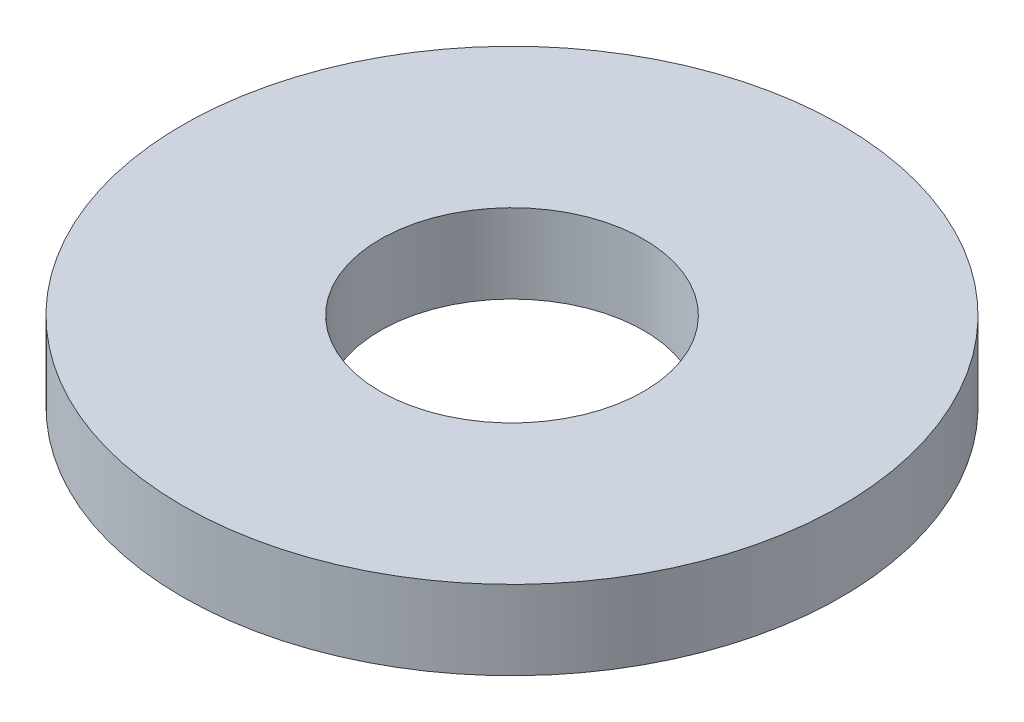
ISO-10303-21;
HEADER;
FILE_DESCRIPTION(('STEP AP214'),'2;1');
FILE_NAME('part.step','',(''),(''),'','','');
FILE_SCHEMA(('AUTOMOTIVE_DESIGN { 1 0 10303 214 1 1 1 1 }'));
ENDSEC;
DATA;
#1=APPLICATION_CONTEXT('core data for automotive mechanical design processes');
#2=APPLICATION_PROTOCOL_DEFINITION('international standard','automotive_design',2000,#1);
#3=PRODUCT_CONTEXT('',#1,'mechanical');
#4=PRODUCT('Part','Part','',(#3));
#5=PRODUCT_RELATED_PRODUCT_CATEGORY('part','',(#4));
#6=PRODUCT_DEFINITION_FORMATION('','',#4);
#7=PRODUCT_DEFINITION_CONTEXT('part definition',#1,'design');
#8=PRODUCT_DEFINITION('design','',#6,#7);
#9=PRODUCT_DEFINITION_SHAPE('','',#8);
#10=(LENGTH_UNIT() NAMED_UNIT(*) SI_UNIT(.MILLI.,.METRE.));
#11=(NAMED_UNIT(*) PLANE_ANGLE_UNIT() SI_UNIT($,.RADIAN.));
#12=(NAMED_UNIT(*) SI_UNIT($,.STERADIAN.) SOLID_ANGLE_UNIT());
#13=UNCERTAINTY_MEASURE_WITH_UNIT(LENGTH_MEASURE(1.E-05),#10,'distance_accuracy_value','');
#14=(GEOMETRIC_REPRESENTATION_CONTEXT(3) GLOBAL_UNCERTAINTY_ASSIGNED_CONTEXT((#13)) GLOBAL_UNIT_ASSIGNED_CONTEXT((#10,
#11,#12)) REPRESENTATION_CONTEXT('',''));
#15=CARTESIAN_POINT('',(0.,0.,0.));
#16=DIRECTION('',(0.,0.,1.));
#17=DIRECTION('',(1.,0.,0.));
#18=AXIS2_PLACEMENT_3D('',#15,#16,#17);
#19=CARTESIAN_POINT('',(0.,15.,0.));
#20=DIRECTION('',(0.,-1.,0.));
#21=DIRECTION('',(0.,0.,-1.));
#22=AXIS2_PLACEMENT_3D('',#19,#20,#21);
#23=CYLINDRICAL_SURFACE('',#22,62.5);
#24=CARTESIAN_POINT('',(0.,15.,0.));
#25=DIRECTION('',(0.,1.,0.));
#26=DIRECTION('',(0.,0.,1.));
#27=AXIS2_PLACEMENT_3D('',#24,#25,#26);
#28=CIRCLE('',#27,62.5);
#29=CARTESIAN_POINT('',(0.,15.,62.5));
#30=VERTEX_POINT('',#29);
#31=EDGE_CURVE('E10',#30,#30,#28,.T.);
#32=ORIENTED_EDGE('',*,*,#31,.F.);
#33=EDGE_LOOP('',(#32));
#34=FACE_BOUND('',#33,.T.);
#35=CARTESIAN_POINT('',(0.,0.,0.));
#36=DIRECTION('',(0.,1.,0.));
#37=DIRECTION('',(0.,0.,1.));
#38=AXIS2_PLACEMENT_3D('',#35,#36,#37);
#39=CIRCLE('',#38,62.5);
#40=CARTESIAN_POINT('',(0.,0.,62.5));
#41=VERTEX_POINT('',#40);
#42=EDGE_CURVE('E37',#41,#41,#39,.T.);
#43=ORIENTED_EDGE('',*,*,#42,.T.);
#44=EDGE_LOOP('',(#43));
#45=FACE_BOUND('',#44,.T.);
#46=ADVANCED_FACE('F40',(#34,#45),#23,.T.);
#47=CARTESIAN_POINT('',(0.,15.,0.));
#48=DIRECTION('',(0.,1.,0.));
#49=DIRECTION('',(0.,0.,1.));
#50=AXIS2_PLACEMENT_3D('',#47,#48,#49);
#51=PLANE('',#50);
#52=CARTESIAN_POINT('',(0.,15.,0.));
#53=DIRECTION('',(0.,1.,0.));
#54=DIRECTION('',(0.,0.,1.));
#55=AXIS2_PLACEMENT_3D('',#52,#53,#54);
#56=CIRCLE('',#55,25.);
#57=CARTESIAN_POINT('',(0.,15.,25.));
#58=VERTEX_POINT('',#57);
#59=EDGE_CURVE('E50',#58,#58,#56,.T.);
#60=ORIENTED_EDGE('',*,*,#59,.F.);
#61=EDGE_LOOP('',(#60));
#62=FACE_BOUND('',#61,.T.);
#63=ORIENTED_EDGE('',*,*,#31,.T.);
#64=EDGE_LOOP('',(#63));
#65=FACE_BOUND('',#64,.T.);
#66=ADVANCED_FACE('F59',(#62,#65),#51,.T.);
#67=CARTESIAN_POINT('',(0.,0.,0.));
#68=DIRECTION('',(0.,1.,0.));
#69=DIRECTION('',(0.,0.,1.));
#70=AXIS2_PLACEMENT_3D('',#67,#68,#69);
#71=PLANE('',#70);
#72=CARTESIAN_POINT('',(0.,0.,0.));
#73=DIRECTION('',(0.,1.,0.));
#74=DIRECTION('',(0.,0.,1.));
#75=AXIS2_PLACEMENT_3D('',#72,#73,#74);
#76=CIRCLE('',#75,25.);
#77=CARTESIAN_POINT('',(0.,0.,25.));
#78=VERTEX_POINT('',#77);
#79=EDGE_CURVE('E47',#78,#78,#76,.T.);
#80=ORIENTED_EDGE('',*,*,#79,.T.);
#81=EDGE_LOOP('',(#80));
#82=FACE_BOUND('',#81,.T.);
#83=ORIENTED_EDGE('',*,*,#42,.F.);
#84=EDGE_LOOP('',(#83));
#85=FACE_BOUND('',#84,.T.);
#86=ADVANCED_FACE('F58',(#82,#85),#71,.F.);
#87=CARTESIAN_POINT('',(0.,15.,0.));
#88=DIRECTION('',(0.,-1.,0.));
#89=DIRECTION('',(0.,0.,-1.));
#90=AXIS2_PLACEMENT_3D('',#87,#88,#89);
#91=CYLINDRICAL_SURFACE('',#90,25.);
#92=ORIENTED_EDGE('',*,*,#59,.T.);
#93=EDGE_LOOP('',(#92));
#94=FACE_BOUND('',#93,.T.);
#95=ORIENTED_EDGE('',*,*,#79,.F.);
#96=EDGE_LOOP('',(#95));
#97=FACE_BOUND('',#96,.T.);
#98=ADVANCED_FACE('F54',(#94,#97),#91,.F.);
#99=CLOSED_SHELL('',(#46,#66,#86,#98));
#100=MANIFOLD_SOLID_BREP('B2',#99);
#101=ADVANCED_BREP_SHAPE_REPRESENTATION('',(#18,#100),#14);
#102=SHAPE_DEFINITION_REPRESENTATION(#9,#101);
ENDSEC;
END-ISO-10303-21;
